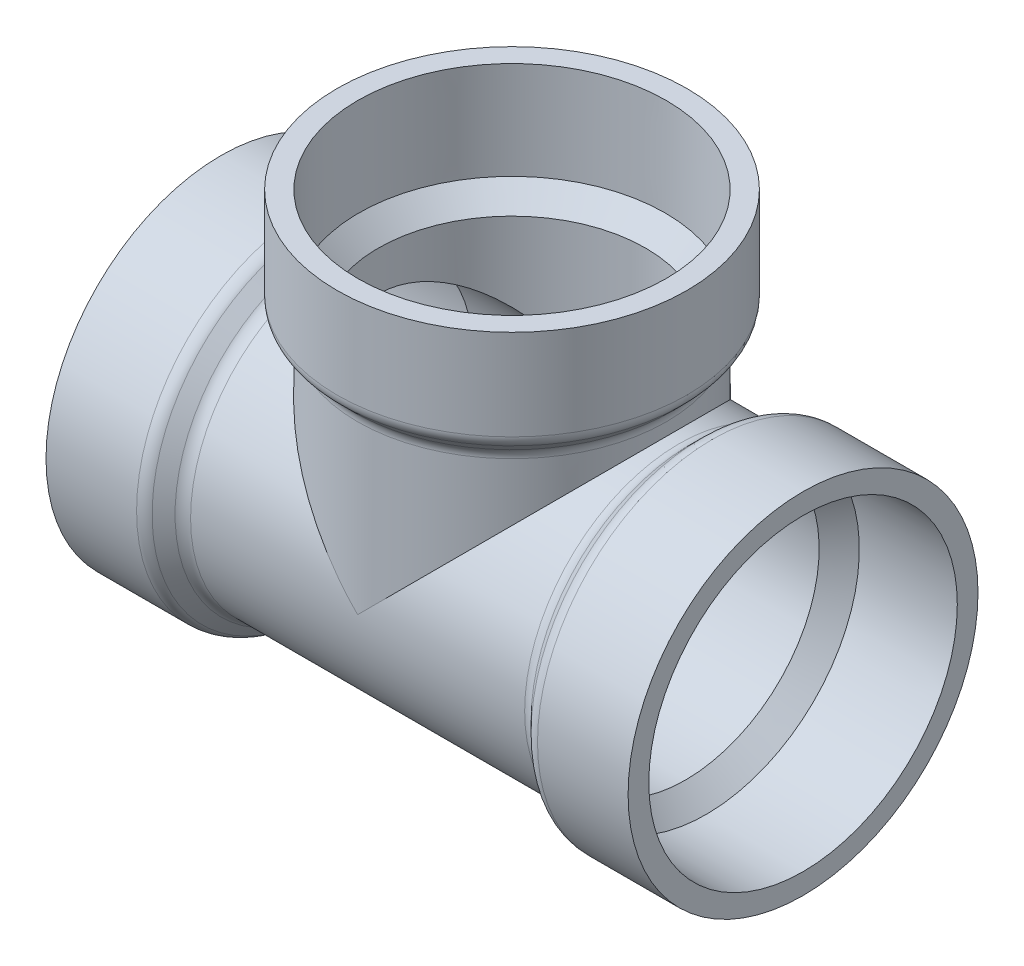
ISO-10303-21;
HEADER;
FILE_DESCRIPTION(('STEP AP214'),'2;1');
FILE_NAME('part.step','',(''),(''),'','','');
FILE_SCHEMA(('AUTOMOTIVE_DESIGN { 1 0 10303 214 1 1 1 1 }'));
ENDSEC;
DATA;
#1=APPLICATION_CONTEXT('core data for automotive mechanical design processes');
#2=APPLICATION_PROTOCOL_DEFINITION('international standard','automotive_design',2000,#1);
#3=PRODUCT_CONTEXT('',#1,'mechanical');
#4=PRODUCT('Part','Part','',(#3));
#5=PRODUCT_RELATED_PRODUCT_CATEGORY('part','',(#4));
#6=PRODUCT_DEFINITION_FORMATION('','',#4);
#7=PRODUCT_DEFINITION_CONTEXT('part definition',#1,'design');
#8=PRODUCT_DEFINITION('design','',#6,#7);
#9=PRODUCT_DEFINITION_SHAPE('','',#8);
#10=(LENGTH_UNIT() NAMED_UNIT(*) SI_UNIT(.MILLI.,.METRE.));
#11=(NAMED_UNIT(*) PLANE_ANGLE_UNIT() SI_UNIT($,.RADIAN.));
#12=(NAMED_UNIT(*) SI_UNIT($,.STERADIAN.) SOLID_ANGLE_UNIT());
#13=UNCERTAINTY_MEASURE_WITH_UNIT(LENGTH_MEASURE(1.E-05),#10,'distance_accuracy_value','');
#14=(GEOMETRIC_REPRESENTATION_CONTEXT(3) GLOBAL_UNCERTAINTY_ASSIGNED_CONTEXT((#13)) GLOBAL_UNIT_ASSIGNED_CONTEXT((#10,
#11,#12)) REPRESENTATION_CONTEXT('',''));
#15=CARTESIAN_POINT('',(0.,0.,0.));
#16=DIRECTION('',(0.,0.,1.));
#17=DIRECTION('',(1.,0.,0.));
#18=AXIS2_PLACEMENT_3D('',#15,#16,#17);
#19=CARTESIAN_POINT('',(0.,-85.7434854439683,0.));
#20=DIRECTION('',(0.,1.,0.));
#21=DIRECTION('',(0.,0.,1.));
#22=AXIS2_PLACEMENT_3D('',#19,#20,#21);
#23=CYLINDRICAL_SURFACE('',#22,30.3149);
#24=CARTESIAN_POINT('',(0.,32.7988770618868,0.));
#25=DIRECTION('',(0.,-1.,0.));
#26=DIRECTION('',(0.,0.,-1.));
#27=AXIS2_PLACEMENT_3D('',#24,#25,#26);
#28=CIRCLE('',#27,30.3149);
#29=CARTESIAN_POINT('',(0.,32.7988770618868,-30.3149));
#30=VERTEX_POINT('',#29);
#31=EDGE_CURVE('E154',#30,#30,#28,.T.);
#32=ORIENTED_EDGE('',*,*,#31,.T.);
#33=EDGE_LOOP('',(#32));
#34=FACE_BOUND('',#33,.T.);
#35=CARTESIAN_POINT('',(0.,0.,0.));
#36=DIRECTION('',(-0.707106781186547,0.707106781186547,0.));
#37=DIRECTION('',(0.707106781186547,0.707106781186547,0.));
#38=AXIS2_PLACEMENT_3D('',#35,#36,#37);
#39=ELLIPSE('',#38,42.8717427219841,30.3149);
#40=CARTESIAN_POINT('',(0.,0.,-30.3149));
#41=VERTEX_POINT('',#40);
#42=CARTESIAN_POINT('',(0.,0.,30.3149));
#43=VERTEX_POINT('',#42);
#44=EDGE_CURVE('E123',#41,#43,#39,.F.);
#45=ORIENTED_EDGE('',*,*,#44,.F.);
#46=CARTESIAN_POINT('',(0.,0.,0.));
#47=DIRECTION('',(0.707106781186547,0.707106781186547,0.));
#48=DIRECTION('',(-0.707106781186547,0.707106781186547,0.));
#49=AXIS2_PLACEMENT_3D('',#46,#47,#48);
#50=ELLIPSE('',#49,42.8717427219841,30.3149);
#51=EDGE_CURVE('E67',#43,#41,#50,.F.);
#52=ORIENTED_EDGE('',*,*,#51,.F.);
#53=EDGE_LOOP('',(#45,#52));
#54=FACE_BOUND('',#53,.T.);
#55=ADVANCED_FACE('F45',(#34,#54),#23,.T.);
#56=CARTESIAN_POINT('',(34.3535,57.15,0.));
#57=DIRECTION('',(0.,1.,0.));
#58=DIRECTION('',(0.,0.,1.));
#59=AXIS2_PLACEMENT_3D('',#56,#57,#58);
#60=PLANE('',#59);
#61=CARTESIAN_POINT('',(0.,57.15,0.));
#62=DIRECTION('',(0.,-1.,0.));
#63=DIRECTION('',(0.,0.,-1.));
#64=AXIS2_PLACEMENT_3D('',#61,#62,#63);
#65=CIRCLE('',#64,30.2895);
#66=CARTESIAN_POINT('',(0.,57.15,-30.2895));
#67=VERTEX_POINT('',#66);
#68=EDGE_CURVE('E126',#67,#67,#65,.T.);
#69=ORIENTED_EDGE('',*,*,#68,.T.);
#70=EDGE_LOOP('',(#69));
#71=FACE_BOUND('',#70,.T.);
#72=CARTESIAN_POINT('',(0.,57.15,0.));
#73=DIRECTION('',(0.,-1.,0.));
#74=DIRECTION('',(0.,0.,-1.));
#75=AXIS2_PLACEMENT_3D('',#72,#73,#74);
#76=CIRCLE('',#75,34.3535);
#77=CARTESIAN_POINT('',(0.,57.15,-34.3535));
#78=VERTEX_POINT('',#77);
#79=EDGE_CURVE('E132',#78,#78,#76,.T.);
#80=ORIENTED_EDGE('',*,*,#79,.F.);
#81=EDGE_LOOP('',(#80));
#82=FACE_BOUND('',#81,.T.);
#83=ADVANCED_FACE('F216',(#71,#82),#60,.T.);
#84=CARTESIAN_POINT('',(0.,0.,0.));
#85=DIRECTION('',(0.,-1.,0.));
#86=DIRECTION('',(0.,0.,-1.));
#87=AXIS2_PLACEMENT_3D('',#84,#85,#86);
#88=CYLINDRICAL_SURFACE('',#87,34.3535);
#89=CARTESIAN_POINT('',(0.,39.3625229381132,0.));
#90=DIRECTION('',(0.,1.,0.));
#91=DIRECTION('',(0.,0.,1.));
#92=AXIS2_PLACEMENT_3D('',#89,#90,#91);
#93=CIRCLE('',#92,34.3535);
#94=CARTESIAN_POINT('',(0.,39.3625229381132,34.3535));
#95=VERTEX_POINT('',#94);
#96=EDGE_CURVE('E163',#95,#95,#93,.T.);
#97=ORIENTED_EDGE('',*,*,#96,.T.);
#98=EDGE_LOOP('',(#97));
#99=FACE_BOUND('',#98,.T.);
#100=ORIENTED_EDGE('',*,*,#79,.T.);
#101=EDGE_LOOP('',(#100));
#102=FACE_BOUND('',#101,.T.);
#103=ADVANCED_FACE('F222',(#99,#102),#88,.T.);
#104=CARTESIAN_POINT('',(0.,34.0614,0.));
#105=DIRECTION('',(0.,1.,0.));
#106=DIRECTION('',(0.,0.,1.));
#107=AXIS2_PLACEMENT_3D('',#104,#105,#106);
#108=CONICAL_SURFACE('',#107,30.3149,0.785398163397449);
#109=CARTESIAN_POINT('',(0.,34.9541385309434,0.));
#110=DIRECTION('',(0.,-1.,0.));
#111=DIRECTION('',(0.,0.,-1.));
#112=AXIS2_PLACEMENT_3D('',#109,#110,#111);
#113=CIRCLE('',#112,31.2076385309434);
#114=CARTESIAN_POINT('',(0.,34.9541385309434,-31.2076385309434));
#115=VERTEX_POINT('',#114);
#116=EDGE_CURVE('E160',#115,#115,#113,.F.);
#117=ORIENTED_EDGE('',*,*,#116,.T.);
#118=EDGE_LOOP('',(#117));
#119=FACE_BOUND('',#118,.T.);
#120=CARTESIAN_POINT('',(0.,37.2072614690566,0.));
#121=DIRECTION('',(0.,-1.,0.));
#122=DIRECTION('',(0.,0.,-1.));
#123=AXIS2_PLACEMENT_3D('',#120,#121,#122);
#124=CIRCLE('',#123,33.4607614690566);
#125=CARTESIAN_POINT('',(0.,37.2072614690566,-33.4607614690566));
#126=VERTEX_POINT('',#125);
#127=EDGE_CURVE('E157',#126,#126,#124,.T.);
#128=ORIENTED_EDGE('',*,*,#127,.T.);
#129=EDGE_LOOP('',(#128));
#130=FACE_BOUND('',#129,.T.);
#131=ADVANCED_FACE('F233',(#119,#130),#108,.T.);
#132=CARTESIAN_POINT('',(0.,38.1,0.));
#133=DIRECTION('',(0.,1.,0.));
#134=DIRECTION('',(0.,0.,1.));
#135=AXIS2_PLACEMENT_3D('',#132,#133,#134);
#136=CONICAL_SURFACE('',#135,30.099,0.761248269999933);
#137=CARTESIAN_POINT('',(0.,34.0614,0.));
#138=DIRECTION('',(0.,-1.,0.));
#139=DIRECTION('',(0.,0.,-1.));
#140=AXIS2_PLACEMENT_3D('',#137,#138,#139);
#141=CIRCLE('',#140,26.2509);
#142=CARTESIAN_POINT('',(0.,34.0614,-26.2509));
#143=VERTEX_POINT('',#142);
#144=EDGE_CURVE('E90',#143,#143,#141,.T.);
#145=ORIENTED_EDGE('',*,*,#144,.T.);
#146=EDGE_LOOP('',(#145));
#147=FACE_BOUND('',#146,.T.);
#148=CARTESIAN_POINT('',(0.,38.1,0.));
#149=DIRECTION('',(0.,-1.,0.));
#150=DIRECTION('',(0.,0.,-1.));
#151=AXIS2_PLACEMENT_3D('',#148,#149,#150);
#152=CIRCLE('',#151,30.099);
#153=CARTESIAN_POINT('',(0.,38.1,-30.099));
#154=VERTEX_POINT('',#153);
#155=EDGE_CURVE('E129',#154,#154,#152,.T.);
#156=ORIENTED_EDGE('',*,*,#155,.F.);
#157=EDGE_LOOP('',(#156));
#158=FACE_BOUND('',#157,.T.);
#159=ADVANCED_FACE('F229',(#147,#158),#136,.F.);
#160=CARTESIAN_POINT('',(0.,57.15,0.));
#161=DIRECTION('',(0.,1.,0.));
#162=DIRECTION('',(0.,0.,1.));
#163=AXIS2_PLACEMENT_3D('',#160,#161,#162);
#164=CONICAL_SURFACE('',#163,30.2895,0.00999966668666505);
#165=ORIENTED_EDGE('',*,*,#155,.T.);
#166=EDGE_LOOP('',(#165));
#167=FACE_BOUND('',#166,.T.);
#168=ORIENTED_EDGE('',*,*,#68,.F.);
#169=EDGE_LOOP('',(#168));
#170=FACE_BOUND('',#169,.T.);
#171=ADVANCED_FACE('F226',(#167,#170),#164,.F.);
#172=CARTESIAN_POINT('',(119.804885443968,0.,0.));
#173=DIRECTION('',(-1.,0.,0.));
#174=DIRECTION('',(0.,0.,1.));
#175=AXIS2_PLACEMENT_3D('',#172,#173,#174);
#176=CYLINDRICAL_SURFACE('',#175,30.3149);
#177=CARTESIAN_POINT('',(32.7988770618868,0.,0.));
#178=DIRECTION('',(-1.,0.,0.));
#179=DIRECTION('',(0.,0.,1.));
#180=AXIS2_PLACEMENT_3D('',#177,#178,#179);
#181=CIRCLE('',#180,30.3149);
#182=CARTESIAN_POINT('',(32.7988770618868,0.,30.3149));
#183=VERTEX_POINT('',#182);
#184=EDGE_CURVE('E150',#183,#183,#181,.T.);
#185=ORIENTED_EDGE('',*,*,#184,.T.);
#186=EDGE_LOOP('',(#185));
#187=FACE_BOUND('',#186,.T.);
#188=CARTESIAN_POINT('',(-32.7988770618868,0.,0.));
#189=DIRECTION('',(1.,0.,0.));
#190=DIRECTION('',(0.,0.,-1.));
#191=AXIS2_PLACEMENT_3D('',#188,#189,#190);
#192=CIRCLE('',#191,30.3149);
#193=CARTESIAN_POINT('',(-32.7988770618868,0.,-30.3149));
#194=VERTEX_POINT('',#193);
#195=EDGE_CURVE('E146',#194,#194,#192,.T.);
#196=ORIENTED_EDGE('',*,*,#195,.T.);
#197=EDGE_LOOP('',(#196));
#198=FACE_BOUND('',#197,.T.);
#199=ORIENTED_EDGE('',*,*,#51,.T.);
#200=ORIENTED_EDGE('',*,*,#44,.T.);
#201=EDGE_LOOP('',(#199,#200));
#202=FACE_BOUND('',#201,.T.);
#203=ADVANCED_FACE('F198',(#187,#198,#202),#176,.T.);
#204=CARTESIAN_POINT('',(-57.15,-34.3535,0.));
#205=DIRECTION('',(-1.,0.,0.));
#206=DIRECTION('',(0.,0.,1.));
#207=AXIS2_PLACEMENT_3D('',#204,#205,#206);
#208=PLANE('',#207);
#209=CARTESIAN_POINT('',(-57.15,0.,0.));
#210=DIRECTION('',(-1.,0.,0.));
#211=DIRECTION('',(0.,0.,1.));
#212=AXIS2_PLACEMENT_3D('',#209,#210,#211);
#213=CIRCLE('',#212,34.3535);
#214=CARTESIAN_POINT('',(-57.15,0.,34.3535));
#215=VERTEX_POINT('',#214);
#216=EDGE_CURVE('E110',#215,#215,#213,.T.);
#217=ORIENTED_EDGE('',*,*,#216,.T.);
#218=EDGE_LOOP('',(#217));
#219=FACE_BOUND('',#218,.T.);
#220=CARTESIAN_POINT('',(-57.15,0.,0.));
#221=DIRECTION('',(-1.,0.,0.));
#222=DIRECTION('',(0.,0.,1.));
#223=AXIS2_PLACEMENT_3D('',#220,#221,#222);
#224=CIRCLE('',#223,30.2895);
#225=CARTESIAN_POINT('',(-57.15,0.,30.2895));
#226=VERTEX_POINT('',#225);
#227=EDGE_CURVE('E118',#226,#226,#224,.T.);
#228=ORIENTED_EDGE('',*,*,#227,.F.);
#229=EDGE_LOOP('',(#228));
#230=FACE_BOUND('',#229,.T.);
#231=ADVANCED_FACE('F194',(#219,#230),#208,.T.);
#232=CARTESIAN_POINT('',(-38.1,0.,0.));
#233=DIRECTION('',(-1.,0.,0.));
#234=DIRECTION('',(0.,0.,1.));
#235=AXIS2_PLACEMENT_3D('',#232,#233,#234);
#236=CONICAL_SURFACE('',#235,30.099,0.00999966668666504);
#237=ORIENTED_EDGE('',*,*,#227,.T.);
#238=EDGE_LOOP('',(#237));
#239=FACE_BOUND('',#238,.T.);
#240=CARTESIAN_POINT('',(-38.1,0.,0.));
#241=DIRECTION('',(-1.,0.,0.));
#242=DIRECTION('',(0.,0.,1.));
#243=AXIS2_PLACEMENT_3D('',#240,#241,#242);
#244=CIRCLE('',#243,30.099);
#245=CARTESIAN_POINT('',(-38.1,0.,30.099));
#246=VERTEX_POINT('',#245);
#247=EDGE_CURVE('E114',#246,#246,#244,.T.);
#248=ORIENTED_EDGE('',*,*,#247,.F.);
#249=EDGE_LOOP('',(#248));
#250=FACE_BOUND('',#249,.T.);
#251=ADVANCED_FACE('F197',(#239,#250),#236,.F.);
#252=CARTESIAN_POINT('',(-34.0614,0.,0.));
#253=DIRECTION('',(-1.,0.,0.));
#254=DIRECTION('',(0.,0.,1.));
#255=AXIS2_PLACEMENT_3D('',#252,#253,#254);
#256=CONICAL_SURFACE('',#255,26.2509,0.761248269999931);
#257=ORIENTED_EDGE('',*,*,#247,.T.);
#258=EDGE_LOOP('',(#257));
#259=FACE_BOUND('',#258,.T.);
#260=CARTESIAN_POINT('',(-34.0614,0.,0.));
#261=DIRECTION('',(-1.,0.,0.));
#262=DIRECTION('',(0.,-1.,0.));
#263=AXIS2_PLACEMENT_3D('',#260,#261,#262);
#264=CIRCLE('',#263,26.2509);
#265=CARTESIAN_POINT('',(-34.0614,-26.2509,0.));
#266=VERTEX_POINT('',#265);
#267=EDGE_CURVE('E84',#266,#266,#264,.T.);
#268=ORIENTED_EDGE('',*,*,#267,.F.);
#269=EDGE_LOOP('',(#268));
#270=FACE_BOUND('',#269,.T.);
#271=ADVANCED_FACE('F204',(#259,#270),#256,.F.);
#272=CARTESIAN_POINT('',(-38.1,0.,0.));
#273=DIRECTION('',(-1.,0.,0.));
#274=DIRECTION('',(0.,0.,1.));
#275=AXIS2_PLACEMENT_3D('',#272,#273,#274);
#276=CONICAL_SURFACE('',#275,34.3535,0.785398163397444);
#277=CARTESIAN_POINT('',(-37.2072614690566,0.,0.));
#278=DIRECTION('',(1.,0.,0.));
#279=DIRECTION('',(0.,0.,-1.));
#280=AXIS2_PLACEMENT_3D('',#277,#278,#279);
#281=CIRCLE('',#280,33.4607614690566);
#282=CARTESIAN_POINT('',(-37.2072614690566,0.,-33.4607614690566));
#283=VERTEX_POINT('',#282);
#284=EDGE_CURVE('E76',#283,#283,#281,.T.);
#285=ORIENTED_EDGE('',*,*,#284,.T.);
#286=EDGE_LOOP('',(#285));
#287=FACE_BOUND('',#286,.T.);
#288=CARTESIAN_POINT('',(-34.9541385309434,0.,0.));
#289=DIRECTION('',(1.,0.,0.));
#290=DIRECTION('',(0.,0.,-1.));
#291=AXIS2_PLACEMENT_3D('',#288,#289,#290);
#292=CIRCLE('',#291,31.2076385309434);
#293=CARTESIAN_POINT('',(-34.9541385309434,0.,-31.2076385309434));
#294=VERTEX_POINT('',#293);
#295=EDGE_CURVE('E170',#294,#294,#292,.F.);
#296=ORIENTED_EDGE('',*,*,#295,.T.);
#297=EDGE_LOOP('',(#296));
#298=FACE_BOUND('',#297,.T.);
#299=ADVANCED_FACE('F178',(#287,#298),#276,.T.);
#300=CARTESIAN_POINT('',(-57.15,0.,0.));
#301=DIRECTION('',(-1.,0.,0.));
#302=DIRECTION('',(0.,0.,1.));
#303=AXIS2_PLACEMENT_3D('',#300,#301,#302);
#304=CYLINDRICAL_SURFACE('',#303,34.3535);
#305=CARTESIAN_POINT('',(-39.3625229381132,0.,0.));
#306=DIRECTION('',(1.,0.,0.));
#307=DIRECTION('',(0.,0.,-1.));
#308=AXIS2_PLACEMENT_3D('',#305,#306,#307);
#309=CIRCLE('',#308,34.3535);
#310=CARTESIAN_POINT('',(-39.3625229381132,0.,-34.3535));
#311=VERTEX_POINT('',#310);
#312=EDGE_CURVE('E166',#311,#311,#309,.F.);
#313=ORIENTED_EDGE('',*,*,#312,.T.);
#314=EDGE_LOOP('',(#313));
#315=FACE_BOUND('',#314,.T.);
#316=ORIENTED_EDGE('',*,*,#216,.F.);
#317=EDGE_LOOP('',(#316));
#318=FACE_BOUND('',#317,.T.);
#319=ADVANCED_FACE('F187',(#315,#318),#304,.T.);
#320=CARTESIAN_POINT('',(57.15,-34.3535,0.));
#321=DIRECTION('',(1.,0.,0.));
#322=DIRECTION('',(0.,0.,1.));
#323=AXIS2_PLACEMENT_3D('',#320,#321,#322);
#324=PLANE('',#323);
#325=CARTESIAN_POINT('',(57.15,0.,0.));
#326=DIRECTION('',(-1.,0.,0.));
#327=DIRECTION('',(0.,0.,1.));
#328=AXIS2_PLACEMENT_3D('',#325,#326,#327);
#329=CIRCLE('',#328,34.3535);
#330=CARTESIAN_POINT('',(57.15,0.,34.3535));
#331=VERTEX_POINT('',#330);
#332=EDGE_CURVE('E95',#331,#331,#329,.T.);
#333=ORIENTED_EDGE('',*,*,#332,.F.);
#334=EDGE_LOOP('',(#333));
#335=FACE_BOUND('',#334,.T.);
#336=CARTESIAN_POINT('',(57.15,0.,0.));
#337=DIRECTION('',(-1.,0.,0.));
#338=DIRECTION('',(0.,0.,1.));
#339=AXIS2_PLACEMENT_3D('',#336,#337,#338);
#340=CIRCLE('',#339,30.2895);
#341=CARTESIAN_POINT('',(57.15,0.,30.2895));
#342=VERTEX_POINT('',#341);
#343=EDGE_CURVE('E106',#342,#342,#340,.T.);
#344=ORIENTED_EDGE('',*,*,#343,.T.);
#345=EDGE_LOOP('',(#344));
#346=FACE_BOUND('',#345,.T.);
#347=ADVANCED_FACE('F190',(#335,#346),#324,.T.);
#348=CARTESIAN_POINT('',(38.1,0.,0.));
#349=DIRECTION('',(1.,0.,0.));
#350=DIRECTION('',(0.,0.,1.));
#351=AXIS2_PLACEMENT_3D('',#348,#349,#350);
#352=CONICAL_SURFACE('',#351,30.099,0.00999966668666504);
#353=ORIENTED_EDGE('',*,*,#343,.F.);
#354=EDGE_LOOP('',(#353));
#355=FACE_BOUND('',#354,.T.);
#356=CARTESIAN_POINT('',(38.1,0.,0.));
#357=DIRECTION('',(-1.,0.,0.));
#358=DIRECTION('',(0.,0.,1.));
#359=AXIS2_PLACEMENT_3D('',#356,#357,#358);
#360=CIRCLE('',#359,30.099);
#361=CARTESIAN_POINT('',(38.1,0.,30.099));
#362=VERTEX_POINT('',#361);
#363=EDGE_CURVE('E102',#362,#362,#360,.T.);
#364=ORIENTED_EDGE('',*,*,#363,.T.);
#365=EDGE_LOOP('',(#364));
#366=FACE_BOUND('',#365,.T.);
#367=ADVANCED_FACE('F349',(#355,#366),#352,.F.);
#368=CARTESIAN_POINT('',(34.0614,0.,0.));
#369=DIRECTION('',(1.,0.,0.));
#370=DIRECTION('',(0.,0.,1.));
#371=AXIS2_PLACEMENT_3D('',#368,#369,#370);
#372=CONICAL_SURFACE('',#371,26.2509,0.761248269999931);
#373=ORIENTED_EDGE('',*,*,#363,.F.);
#374=EDGE_LOOP('',(#373));
#375=FACE_BOUND('',#374,.T.);
#376=CARTESIAN_POINT('',(34.0614,0.,0.));
#377=DIRECTION('',(-1.,0.,0.));
#378=DIRECTION('',(0.,-1.,0.));
#379=AXIS2_PLACEMENT_3D('',#376,#377,#378);
#380=CIRCLE('',#379,26.2509);
#381=CARTESIAN_POINT('',(34.0614,-26.2509,0.));
#382=VERTEX_POINT('',#381);
#383=EDGE_CURVE('E87',#382,#382,#380,.T.);
#384=ORIENTED_EDGE('',*,*,#383,.T.);
#385=EDGE_LOOP('',(#384));
#386=FACE_BOUND('',#385,.T.);
#387=ADVANCED_FACE('F340',(#375,#386),#372,.F.);
#388=CARTESIAN_POINT('',(38.1,0.,0.));
#389=DIRECTION('',(1.,0.,0.));
#390=DIRECTION('',(0.,0.,1.));
#391=AXIS2_PLACEMENT_3D('',#388,#389,#390);
#392=CONICAL_SURFACE('',#391,34.3535,0.785398163397444);
#393=CARTESIAN_POINT('',(37.2072614690566,0.,0.));
#394=DIRECTION('',(-1.,0.,0.));
#395=DIRECTION('',(0.,0.,1.));
#396=AXIS2_PLACEMENT_3D('',#393,#394,#395);
#397=CIRCLE('',#396,33.4607614690566);
#398=CARTESIAN_POINT('',(37.2072614690566,0.,33.4607614690566));
#399=VERTEX_POINT('',#398);
#400=EDGE_CURVE('E139',#399,#399,#397,.T.);
#401=ORIENTED_EDGE('',*,*,#400,.T.);
#402=EDGE_LOOP('',(#401));
#403=FACE_BOUND('',#402,.T.);
#404=CARTESIAN_POINT('',(34.9541385309434,0.,0.));
#405=DIRECTION('',(-1.,0.,0.));
#406=DIRECTION('',(0.,0.,1.));
#407=AXIS2_PLACEMENT_3D('',#404,#405,#406);
#408=CIRCLE('',#407,31.2076385309434);
#409=CARTESIAN_POINT('',(34.9541385309434,0.,31.2076385309434));
#410=VERTEX_POINT('',#409);
#411=EDGE_CURVE('E135',#410,#410,#408,.F.);
#412=ORIENTED_EDGE('',*,*,#411,.T.);
#413=EDGE_LOOP('',(#412));
#414=FACE_BOUND('',#413,.T.);
#415=ADVANCED_FACE('F330',(#403,#414),#392,.T.);
#416=CARTESIAN_POINT('',(57.15,0.,0.));
#417=DIRECTION('',(1.,0.,0.));
#418=DIRECTION('',(0.,0.,1.));
#419=AXIS2_PLACEMENT_3D('',#416,#417,#418);
#420=CYLINDRICAL_SURFACE('',#419,34.3535);
#421=CARTESIAN_POINT('',(39.3625229381132,0.,0.));
#422=DIRECTION('',(1.,0.,0.));
#423=DIRECTION('',(0.,0.,-1.));
#424=AXIS2_PLACEMENT_3D('',#421,#422,#423);
#425=CIRCLE('',#424,34.3535);
#426=CARTESIAN_POINT('',(39.3625229381132,0.,-34.3535));
#427=VERTEX_POINT('',#426);
#428=EDGE_CURVE('E143',#427,#427,#425,.T.);
#429=ORIENTED_EDGE('',*,*,#428,.T.);
#430=EDGE_LOOP('',(#429));
#431=FACE_BOUND('',#430,.T.);
#432=ORIENTED_EDGE('',*,*,#332,.T.);
#433=EDGE_LOOP('',(#432));
#434=FACE_BOUND('',#433,.T.);
#435=ADVANCED_FACE('F245',(#431,#434),#420,.T.);
#436=CARTESIAN_POINT('',(39.3625229381132,0.,0.));
#437=DIRECTION('',(1.,0.,0.));
#438=DIRECTION('',(0.,0.,-1.));
#439=AXIS2_PLACEMENT_3D('',#436,#437,#438);
#440=TOROIDAL_SURFACE('',#439,31.3055,3.048);
#441=ORIENTED_EDGE('',*,*,#428,.F.);
#442=EDGE_LOOP('',(#441));
#443=FACE_BOUND('',#442,.T.);
#444=ORIENTED_EDGE('',*,*,#400,.F.);
#445=EDGE_LOOP('',(#444));
#446=FACE_BOUND('',#445,.T.);
#447=ADVANCED_FACE('F241',(#443,#446),#440,.T.);
#448=CARTESIAN_POINT('',(32.7988770618868,0.,0.));
#449=DIRECTION('',(-1.,0.,0.));
#450=DIRECTION('',(0.,0.,1.));
#451=AXIS2_PLACEMENT_3D('',#448,#449,#450);
#452=TOROIDAL_SURFACE('',#451,33.3629,3.048);
#453=ORIENTED_EDGE('',*,*,#411,.F.);
#454=EDGE_LOOP('',(#453));
#455=FACE_BOUND('',#454,.T.);
#456=ORIENTED_EDGE('',*,*,#184,.F.);
#457=EDGE_LOOP('',(#456));
#458=FACE_BOUND('',#457,.T.);
#459=ADVANCED_FACE('F244',(#455,#458),#452,.F.);
#460=CARTESIAN_POINT('',(0.,32.7988770618868,0.));
#461=DIRECTION('',(0.,-1.,0.));
#462=DIRECTION('',(0.,0.,-1.));
#463=AXIS2_PLACEMENT_3D('',#460,#461,#462);
#464=TOROIDAL_SURFACE('',#463,33.3629,3.048);
#465=ORIENTED_EDGE('',*,*,#116,.F.);
#466=EDGE_LOOP('',(#465));
#467=FACE_BOUND('',#466,.T.);
#468=ORIENTED_EDGE('',*,*,#31,.F.);
#469=EDGE_LOOP('',(#468));
#470=FACE_BOUND('',#469,.T.);
#471=ADVANCED_FACE('F249',(#467,#470),#464,.F.);
#472=CARTESIAN_POINT('',(0.,39.3625229381132,0.));
#473=DIRECTION('',(0.,1.,0.));
#474=DIRECTION('',(0.,0.,1.));
#475=AXIS2_PLACEMENT_3D('',#472,#473,#474);
#476=TOROIDAL_SURFACE('',#475,31.3055,3.048);
#477=ORIENTED_EDGE('',*,*,#96,.F.);
#478=EDGE_LOOP('',(#477));
#479=FACE_BOUND('',#478,.T.);
#480=ORIENTED_EDGE('',*,*,#127,.F.);
#481=EDGE_LOOP('',(#480));
#482=FACE_BOUND('',#481,.T.);
#483=ADVANCED_FACE('F184',(#479,#482),#476,.T.);
#484=CARTESIAN_POINT('',(-39.3625229381132,0.,0.));
#485=DIRECTION('',(1.,0.,0.));
#486=DIRECTION('',(0.,0.,-1.));
#487=AXIS2_PLACEMENT_3D('',#484,#485,#486);
#488=TOROIDAL_SURFACE('',#487,31.3055,3.048);
#489=ORIENTED_EDGE('',*,*,#284,.F.);
#490=EDGE_LOOP('',(#489));
#491=FACE_BOUND('',#490,.T.);
#492=ORIENTED_EDGE('',*,*,#312,.F.);
#493=EDGE_LOOP('',(#492));
#494=FACE_BOUND('',#493,.T.);
#495=ADVANCED_FACE('F181',(#491,#494),#488,.T.);
#496=CARTESIAN_POINT('',(-32.7988770618868,0.,0.));
#497=DIRECTION('',(1.,0.,0.));
#498=DIRECTION('',(0.,0.,-1.));
#499=AXIS2_PLACEMENT_3D('',#496,#497,#498);
#500=TOROIDAL_SURFACE('',#499,33.3629,3.048);
#501=ORIENTED_EDGE('',*,*,#295,.F.);
#502=EDGE_LOOP('',(#501));
#503=FACE_BOUND('',#502,.T.);
#504=ORIENTED_EDGE('',*,*,#195,.F.);
#505=EDGE_LOOP('',(#504));
#506=FACE_BOUND('',#505,.T.);
#507=ADVANCED_FACE('F47',(#503,#506),#500,.F.);
#508=CARTESIAN_POINT('',(-57.15,0.,0.));
#509=DIRECTION('',(-1.,0.,0.));
#510=DIRECTION('',(0.,-1.,0.));
#511=AXIS2_PLACEMENT_3D('',#508,#509,#510);
#512=CYLINDRICAL_SURFACE('',#511,26.2509);
#513=CARTESIAN_POINT('',(0.,0.,0.));
#514=DIRECTION('',(-0.707106781186547,-0.707106781186548,0.));
#515=DIRECTION('',(-0.707106781186548,0.707106781186547,0.));
#516=AXIS2_PLACEMENT_3D('',#513,#514,#515);
#517=ELLIPSE('',#516,37.1243788044999,26.2509);
#518=CARTESIAN_POINT('',(0.,0.,26.2509));
#519=VERTEX_POINT('',#518);
#520=CARTESIAN_POINT('',(0.,0.,-26.2509));
#521=VERTEX_POINT('',#520);
#522=EDGE_CURVE('E11',#519,#521,#517,.T.);
#523=ORIENTED_EDGE('',*,*,#522,.F.);
#524=CARTESIAN_POINT('',(0.,0.,0.));
#525=DIRECTION('',(-0.707106781186548,0.707106781186547,0.));
#526=DIRECTION('',(-0.707106781186547,-0.707106781186548,0.));
#527=AXIS2_PLACEMENT_3D('',#524,#525,#526);
#528=ELLIPSE('',#527,37.1243788044999,26.2509);
#529=EDGE_CURVE('E54',#521,#519,#528,.F.);
#530=ORIENTED_EDGE('',*,*,#529,.F.);
#531=EDGE_LOOP('',(#523,#530));
#532=FACE_BOUND('',#531,.T.);
#533=ORIENTED_EDGE('',*,*,#267,.T.);
#534=EDGE_LOOP('',(#533));
#535=FACE_BOUND('',#534,.T.);
#536=ORIENTED_EDGE('',*,*,#383,.F.);
#537=EDGE_LOOP('',(#536));
#538=FACE_BOUND('',#537,.T.);
#539=ADVANCED_FACE('F77',(#532,#535,#538),#512,.F.);
#540=CARTESIAN_POINT('',(0.,0.,0.));
#541=DIRECTION('',(0.,-1.,0.));
#542=DIRECTION('',(0.,0.,-1.));
#543=AXIS2_PLACEMENT_3D('',#540,#541,#542);
#544=CYLINDRICAL_SURFACE('',#543,26.2509);
#545=ORIENTED_EDGE('',*,*,#522,.T.);
#546=ORIENTED_EDGE('',*,*,#529,.T.);
#547=EDGE_LOOP('',(#545,#546));
#548=FACE_BOUND('',#547,.T.);
#549=ORIENTED_EDGE('',*,*,#144,.F.);
#550=EDGE_LOOP('',(#549));
#551=FACE_BOUND('',#550,.T.);
#552=ADVANCED_FACE('F72',(#548,#551),#544,.F.);
#553=CLOSED_SHELL('',(#55,#83,#103,#131,#159,#171,#203,#231,#251,#271,#299,#319,#347,#367,#387,
#415,#435,#447,#459,#471,#483,#495,#507,#539,#552));
#554=MANIFOLD_SOLID_BREP('B2',#553);
#555=ADVANCED_BREP_SHAPE_REPRESENTATION('',(#18,#554),#14);
#556=SHAPE_DEFINITION_REPRESENTATION(#9,#555);
ENDSEC;
END-ISO-10303-21;
